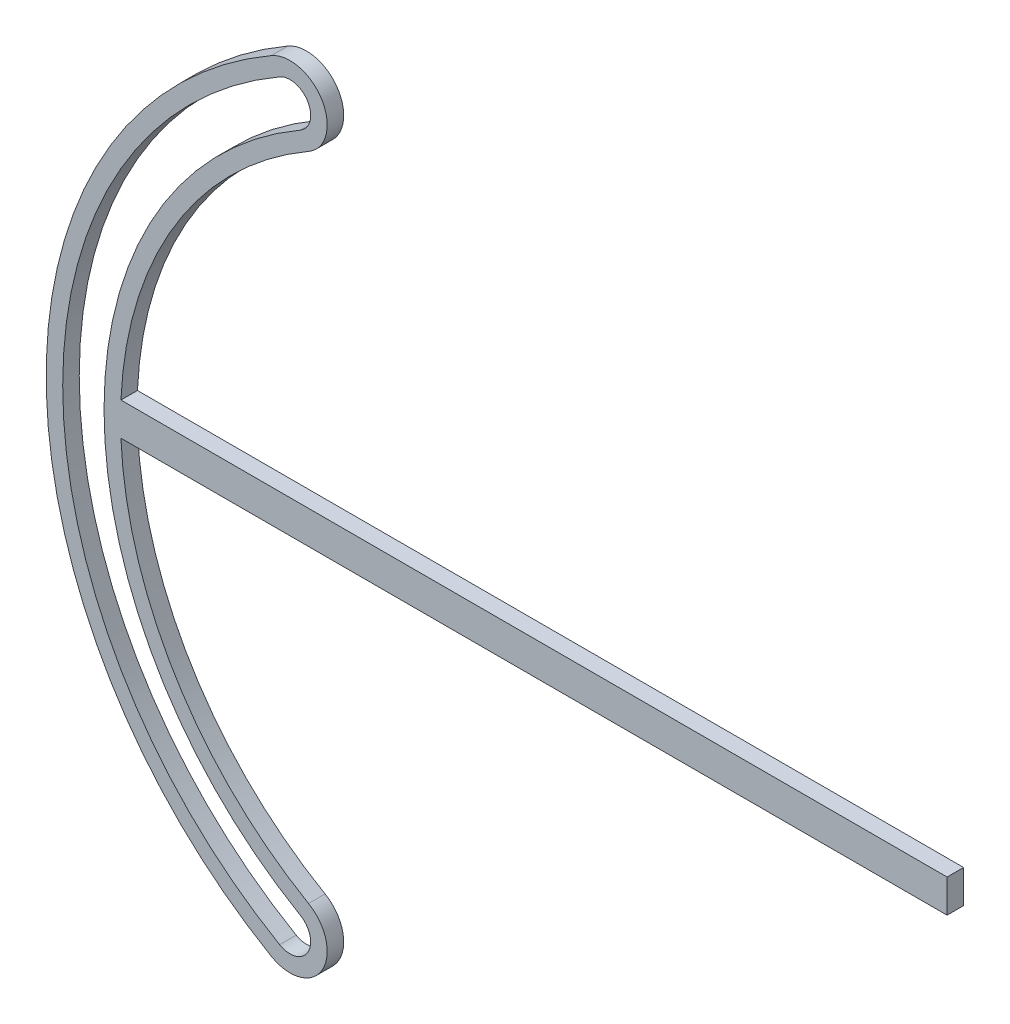
ISO-10303-21;
HEADER;
FILE_DESCRIPTION(('STEP AP214'),'2;1');
FILE_NAME('part.step','',(''),(''),'','','');
FILE_SCHEMA(('AUTOMOTIVE_DESIGN { 1 0 10303 214 1 1 1 1 }'));
ENDSEC;
DATA;
#1=APPLICATION_CONTEXT('core data for automotive mechanical design processes');
#2=APPLICATION_PROTOCOL_DEFINITION('international standard','automotive_design',2000,#1);
#3=PRODUCT_CONTEXT('',#1,'mechanical');
#4=PRODUCT('Part','Part','',(#3));
#5=PRODUCT_RELATED_PRODUCT_CATEGORY('part','',(#4));
#6=PRODUCT_DEFINITION_FORMATION('','',#4);
#7=PRODUCT_DEFINITION_CONTEXT('part definition',#1,'design');
#8=PRODUCT_DEFINITION('design','',#6,#7);
#9=PRODUCT_DEFINITION_SHAPE('','',#8);
#10=(LENGTH_UNIT() NAMED_UNIT(*) SI_UNIT(.MILLI.,.METRE.));
#11=(NAMED_UNIT(*) PLANE_ANGLE_UNIT() SI_UNIT($,.RADIAN.));
#12=(NAMED_UNIT(*) SI_UNIT($,.STERADIAN.) SOLID_ANGLE_UNIT());
#13=UNCERTAINTY_MEASURE_WITH_UNIT(LENGTH_MEASURE(1.E-05),#10,'distance_accuracy_value','');
#14=(GEOMETRIC_REPRESENTATION_CONTEXT(3) GLOBAL_UNCERTAINTY_ASSIGNED_CONTEXT((#13)) GLOBAL_UNIT_ASSIGNED_CONTEXT((#10,
#11,#12)) REPRESENTATION_CONTEXT('',''));
#15=CARTESIAN_POINT('',(0.,0.,0.));
#16=DIRECTION('',(0.,0.,1.));
#17=DIRECTION('',(1.,0.,0.));
#18=AXIS2_PLACEMENT_3D('',#15,#16,#17);
#19=CARTESIAN_POINT('',(0.,0.,4.));
#20=DIRECTION('',(0.,0.,-1.));
#21=DIRECTION('',(-1.,0.,0.));
#22=AXIS2_PLACEMENT_3D('',#19,#20,#21);
#23=CYLINDRICAL_SURFACE('',#22,91.);
#24=CARTESIAN_POINT('',(0.,0.,0.));
#25=DIRECTION('',(0.,0.,1.));
#26=DIRECTION('',(1.,0.,0.));
#27=AXIS2_PLACEMENT_3D('',#24,#25,#26);
#28=CIRCLE('',#27,91.);
#29=CARTESIAN_POINT('',(-45.4999999999998,78.808311744384,0.));
#30=VERTEX_POINT('',#29);
#31=CARTESIAN_POINT('',(-90.9120454065357,4.,0.));
#32=VERTEX_POINT('',#31);
#33=EDGE_CURVE('E169',#30,#32,#28,.T.);
#34=ORIENTED_EDGE('',*,*,#33,.F.);
#35=DIRECTION('',(0.,0.,-1.));
#36=VECTOR('',#35,1.);
#37=CARTESIAN_POINT('',(-45.4999999999998,78.808311744384,4.));
#38=LINE('',#37,#36);
#39=CARTESIAN_POINT('',(-45.4999999999998,78.808311744384,4.));
#40=VERTEX_POINT('',#39);
#41=EDGE_CURVE('E11',#40,#30,#38,.T.);
#42=ORIENTED_EDGE('',*,*,#41,.F.);
#43=CARTESIAN_POINT('',(0.,0.,4.));
#44=DIRECTION('',(0.,0.,1.));
#45=DIRECTION('',(1.,0.,0.));
#46=AXIS2_PLACEMENT_3D('',#43,#44,#45);
#47=CIRCLE('',#46,91.);
#48=CARTESIAN_POINT('',(-90.9120454065357,4.,4.));
#49=VERTEX_POINT('',#48);
#50=EDGE_CURVE('E270',#40,#49,#47,.T.);
#51=ORIENTED_EDGE('',*,*,#50,.T.);
#52=DIRECTION('',(0.,0.,-1.));
#53=VECTOR('',#52,1.);
#54=CARTESIAN_POINT('',(-90.9120454065357,4.,4.));
#55=LINE('',#54,#53);
#56=EDGE_CURVE('E52',#49,#32,#55,.T.);
#57=ORIENTED_EDGE('',*,*,#56,.T.);
#58=EDGE_LOOP('',(#34,#42,#51,#57));
#59=FACE_BOUND('',#58,.T.);
#60=ADVANCED_FACE('F33',(#59),#23,.F.);
#61=CARTESIAN_POINT('',(-49.9999999999998,86.602540378444,4.));
#62=DIRECTION('',(0.,0.,-1.));
#63=DIRECTION('',(-1.,0.,0.));
#64=AXIS2_PLACEMENT_3D('',#61,#62,#63);
#65=CYLINDRICAL_SURFACE('',#64,9.);
#66=CARTESIAN_POINT('',(-49.9999999999998,86.602540378444,0.));
#67=DIRECTION('',(0.,0.,1.));
#68=DIRECTION('',(1.,0.,0.));
#69=AXIS2_PLACEMENT_3D('',#66,#67,#68);
#70=CIRCLE('',#69,9.);
#71=CARTESIAN_POINT('',(-54.4999999999998,94.396769012504,0.));
#72=VERTEX_POINT('',#71);
#73=EDGE_CURVE('E171',#30,#72,#70,.T.);
#74=ORIENTED_EDGE('',*,*,#73,.T.);
#75=DIRECTION('',(0.,0.,-1.));
#76=VECTOR('',#75,1.);
#77=CARTESIAN_POINT('',(-54.4999999999998,94.396769012504,4.));
#78=LINE('',#77,#76);
#79=CARTESIAN_POINT('',(-54.4999999999998,94.396769012504,4.));
#80=VERTEX_POINT('',#79);
#81=EDGE_CURVE('E43',#80,#72,#78,.T.);
#82=ORIENTED_EDGE('',*,*,#81,.F.);
#83=CARTESIAN_POINT('',(-49.9999999999998,86.602540378444,4.));
#84=DIRECTION('',(0.,0.,1.));
#85=DIRECTION('',(1.,0.,0.));
#86=AXIS2_PLACEMENT_3D('',#83,#84,#85);
#87=CIRCLE('',#86,9.);
#88=EDGE_CURVE('E272',#40,#80,#87,.T.);
#89=ORIENTED_EDGE('',*,*,#88,.F.);
#90=ORIENTED_EDGE('',*,*,#41,.T.);
#91=EDGE_LOOP('',(#74,#82,#89,#90));
#92=FACE_BOUND('',#91,.T.);
#93=ADVANCED_FACE('F232',(#92),#65,.T.);
#94=CARTESIAN_POINT('',(0.,0.,4.));
#95=DIRECTION('',(0.,0.,-1.));
#96=DIRECTION('',(-1.,0.,0.));
#97=AXIS2_PLACEMENT_3D('',#94,#95,#96);
#98=CYLINDRICAL_SURFACE('',#97,109.);
#99=CARTESIAN_POINT('',(0.,0.,0.));
#100=DIRECTION('',(0.,0.,1.));
#101=DIRECTION('',(1.,0.,0.));
#102=AXIS2_PLACEMENT_3D('',#99,#100,#101);
#103=CIRCLE('',#102,109.);
#104=CARTESIAN_POINT('',(-54.4999999999998,-94.396769012504,0.));
#105=VERTEX_POINT('',#104);
#106=EDGE_CURVE('E174',#72,#105,#103,.T.);
#107=ORIENTED_EDGE('',*,*,#106,.T.);
#108=DIRECTION('',(0.,0.,-1.));
#109=VECTOR('',#108,1.);
#110=CARTESIAN_POINT('',(-54.4999999999998,-94.396769012504,4.));
#111=LINE('',#110,#109);
#112=CARTESIAN_POINT('',(-54.4999999999998,-94.396769012504,4.));
#113=VERTEX_POINT('',#112);
#114=EDGE_CURVE('E195',#113,#105,#111,.T.);
#115=ORIENTED_EDGE('',*,*,#114,.F.);
#116=CARTESIAN_POINT('',(0.,0.,4.));
#117=DIRECTION('',(0.,0.,1.));
#118=DIRECTION('',(1.,0.,0.));
#119=AXIS2_PLACEMENT_3D('',#116,#117,#118);
#120=CIRCLE('',#119,109.);
#121=EDGE_CURVE('E275',#80,#113,#120,.T.);
#122=ORIENTED_EDGE('',*,*,#121,.F.);
#123=ORIENTED_EDGE('',*,*,#81,.T.);
#124=EDGE_LOOP('',(#107,#115,#122,#123));
#125=FACE_BOUND('',#124,.T.);
#126=ADVANCED_FACE('F237',(#125),#98,.T.);
#127=CARTESIAN_POINT('',(-49.9999999999998,-86.602540378444,4.));
#128=DIRECTION('',(0.,0.,-1.));
#129=DIRECTION('',(-1.,0.,0.));
#130=AXIS2_PLACEMENT_3D('',#127,#128,#129);
#131=CYLINDRICAL_SURFACE('',#130,9.00000000000001);
#132=CARTESIAN_POINT('',(-49.9999999999998,-86.602540378444,0.));
#133=DIRECTION('',(0.,0.,1.));
#134=DIRECTION('',(1.,0.,0.));
#135=AXIS2_PLACEMENT_3D('',#132,#133,#134);
#136=CIRCLE('',#135,9.00000000000001);
#137=CARTESIAN_POINT('',(-45.4999999999998,-78.808311744384,0.));
#138=VERTEX_POINT('',#137);
#139=EDGE_CURVE('E177',#105,#138,#136,.T.);
#140=ORIENTED_EDGE('',*,*,#139,.T.);
#141=DIRECTION('',(0.,0.,-1.));
#142=VECTOR('',#141,1.);
#143=CARTESIAN_POINT('',(-45.4999999999998,-78.808311744384,4.));
#144=LINE('',#143,#142);
#145=CARTESIAN_POINT('',(-45.4999999999998,-78.808311744384,4.));
#146=VERTEX_POINT('',#145);
#147=EDGE_CURVE('E193',#146,#138,#144,.T.);
#148=ORIENTED_EDGE('',*,*,#147,.F.);
#149=CARTESIAN_POINT('',(-49.9999999999998,-86.602540378444,4.));
#150=DIRECTION('',(0.,0.,1.));
#151=DIRECTION('',(1.,0.,0.));
#152=AXIS2_PLACEMENT_3D('',#149,#150,#151);
#153=CIRCLE('',#152,9.00000000000001);
#154=EDGE_CURVE('E278',#113,#146,#153,.T.);
#155=ORIENTED_EDGE('',*,*,#154,.F.);
#156=ORIENTED_EDGE('',*,*,#114,.T.);
#157=EDGE_LOOP('',(#140,#148,#155,#156));
#158=FACE_BOUND('',#157,.T.);
#159=ADVANCED_FACE('F243',(#158),#131,.T.);
#160=CARTESIAN_POINT('',(0.,0.,4.));
#161=DIRECTION('',(0.,0.,-1.));
#162=DIRECTION('',(-1.,0.,0.));
#163=AXIS2_PLACEMENT_3D('',#160,#161,#162);
#164=CYLINDRICAL_SURFACE('',#163,91.);
#165=CARTESIAN_POINT('',(0.,0.,0.));
#166=DIRECTION('',(0.,0.,1.));
#167=DIRECTION('',(1.,0.,0.));
#168=AXIS2_PLACEMENT_3D('',#165,#166,#167);
#169=CIRCLE('',#168,91.);
#170=CARTESIAN_POINT('',(-90.9120454065357,-4.,0.));
#171=VERTEX_POINT('',#170);
#172=EDGE_CURVE('E180',#171,#138,#169,.T.);
#173=ORIENTED_EDGE('',*,*,#172,.F.);
#174=DIRECTION('',(0.,0.,-1.));
#175=VECTOR('',#174,1.);
#176=CARTESIAN_POINT('',(-90.9120454065357,-4.,4.));
#177=LINE('',#176,#175);
#178=CARTESIAN_POINT('',(-90.9120454065357,-4.,4.));
#179=VERTEX_POINT('',#178);
#180=EDGE_CURVE('E138',#179,#171,#177,.T.);
#181=ORIENTED_EDGE('',*,*,#180,.F.);
#182=CARTESIAN_POINT('',(0.,0.,4.));
#183=DIRECTION('',(0.,0.,1.));
#184=DIRECTION('',(1.,0.,0.));
#185=AXIS2_PLACEMENT_3D('',#182,#183,#184);
#186=CIRCLE('',#185,91.);
#187=EDGE_CURVE('E148',#179,#146,#186,.T.);
#188=ORIENTED_EDGE('',*,*,#187,.T.);
#189=ORIENTED_EDGE('',*,*,#147,.T.);
#190=EDGE_LOOP('',(#173,#181,#188,#189));
#191=FACE_BOUND('',#190,.T.);
#192=ADVANCED_FACE('F247',(#191),#164,.F.);
#193=CARTESIAN_POINT('',(-34.5628567237679,-4.,4.));
#194=DIRECTION('',(0.,-1.,0.));
#195=DIRECTION('',(0.,0.,-1.));
#196=AXIS2_PLACEMENT_3D('',#193,#194,#195);
#197=PLANE('',#196);
#198=DIRECTION('',(-1.,0.,0.));
#199=VECTOR('',#198,1.);
#200=CARTESIAN_POINT('',(-34.5628567237679,-4.,0.));
#201=LINE('',#200,#199);
#202=CARTESIAN_POINT('',(109.,-4.,0.));
#203=VERTEX_POINT('',#202);
#204=EDGE_CURVE('E134',#203,#171,#201,.T.);
#205=ORIENTED_EDGE('',*,*,#204,.F.);
#206=DIRECTION('',(0.,0.,-1.));
#207=VECTOR('',#206,1.);
#208=CARTESIAN_POINT('',(109.,-4.,4.));
#209=LINE('',#208,#207);
#210=CARTESIAN_POINT('',(109.,-4.,4.));
#211=VERTEX_POINT('',#210);
#212=EDGE_CURVE('E129',#211,#203,#209,.T.);
#213=ORIENTED_EDGE('',*,*,#212,.F.);
#214=DIRECTION('',(-1.,0.,0.));
#215=VECTOR('',#214,1.);
#216=CARTESIAN_POINT('',(-34.5628567237679,-4.,4.));
#217=LINE('',#216,#215);
#218=EDGE_CURVE('E132',#211,#179,#217,.T.);
#219=ORIENTED_EDGE('',*,*,#218,.T.);
#220=ORIENTED_EDGE('',*,*,#180,.T.);
#221=EDGE_LOOP('',(#205,#213,#219,#220));
#222=FACE_BOUND('',#221,.T.);
#223=ADVANCED_FACE('F131',(#222),#197,.T.);
#224=CARTESIAN_POINT('',(109.,-231.149990770893,4.));
#225=DIRECTION('',(1.,0.,0.));
#226=DIRECTION('',(0.,0.,-1.));
#227=AXIS2_PLACEMENT_3D('',#224,#225,#226);
#228=PLANE('',#227);
#229=DIRECTION('',(0.,-1.,0.));
#230=VECTOR('',#229,1.);
#231=CARTESIAN_POINT('',(109.,-231.149990770893,0.));
#232=LINE('',#231,#230);
#233=CARTESIAN_POINT('',(109.,4.,0.));
#234=VERTEX_POINT('',#233);
#235=EDGE_CURVE('E184',#234,#203,#232,.T.);
#236=ORIENTED_EDGE('',*,*,#235,.F.);
#237=DIRECTION('',(0.,0.,-1.));
#238=VECTOR('',#237,1.);
#239=CARTESIAN_POINT('',(109.,4.,4.));
#240=LINE('',#239,#238);
#241=CARTESIAN_POINT('',(109.,4.,4.));
#242=VERTEX_POINT('',#241);
#243=EDGE_CURVE('E89',#242,#234,#240,.T.);
#244=ORIENTED_EDGE('',*,*,#243,.F.);
#245=DIRECTION('',(0.,-1.,0.));
#246=VECTOR('',#245,1.);
#247=CARTESIAN_POINT('',(109.,-231.149990770893,4.));
#248=LINE('',#247,#246);
#249=EDGE_CURVE('E146',#242,#211,#248,.T.);
#250=ORIENTED_EDGE('',*,*,#249,.T.);
#251=ORIENTED_EDGE('',*,*,#212,.T.);
#252=EDGE_LOOP('',(#236,#244,#250,#251));
#253=FACE_BOUND('',#252,.T.);
#254=ADVANCED_FACE('F150',(#253),#228,.T.);
#255=CARTESIAN_POINT('',(-49.9999999999998,86.602540378444,4.));
#256=DIRECTION('',(0.,0.,-1.));
#257=DIRECTION('',(-1.,0.,0.));
#258=AXIS2_PLACEMENT_3D('',#255,#256,#257);
#259=CYLINDRICAL_SURFACE('',#258,5.);
#260=CARTESIAN_POINT('',(-49.9999999999998,86.602540378444,0.));
#261=DIRECTION('',(0.,0.,1.));
#262=DIRECTION('',(1.,0.,0.));
#263=AXIS2_PLACEMENT_3D('',#260,#261,#262);
#264=CIRCLE('',#263,5.);
#265=CARTESIAN_POINT('',(-47.4999999999998,82.2724133595218,0.));
#266=VERTEX_POINT('',#265);
#267=CARTESIAN_POINT('',(-52.4999999999998,90.9326673973662,0.));
#268=VERTEX_POINT('',#267);
#269=EDGE_CURVE('E157',#266,#268,#264,.T.);
#270=ORIENTED_EDGE('',*,*,#269,.F.);
#271=DIRECTION('',(0.,0.,-1.));
#272=VECTOR('',#271,1.);
#273=CARTESIAN_POINT('',(-47.4999999999998,82.2724133595218,4.));
#274=LINE('',#273,#272);
#275=CARTESIAN_POINT('',(-47.4999999999998,82.2724133595218,4.));
#276=VERTEX_POINT('',#275);
#277=EDGE_CURVE('E37',#276,#266,#274,.T.);
#278=ORIENTED_EDGE('',*,*,#277,.F.);
#279=CARTESIAN_POINT('',(-49.9999999999998,86.602540378444,4.));
#280=DIRECTION('',(0.,0.,1.));
#281=DIRECTION('',(1.,0.,0.));
#282=AXIS2_PLACEMENT_3D('',#279,#280,#281);
#283=CIRCLE('',#282,5.);
#284=CARTESIAN_POINT('',(-52.4999999999998,90.9326673973662,4.));
#285=VERTEX_POINT('',#284);
#286=EDGE_CURVE('E189',#276,#285,#283,.T.);
#287=ORIENTED_EDGE('',*,*,#286,.T.);
#288=DIRECTION('',(0.,0.,-1.));
#289=VECTOR('',#288,1.);
#290=CARTESIAN_POINT('',(-52.4999999999998,90.9326673973662,4.));
#291=LINE('',#290,#289);
#292=EDGE_CURVE('E153',#285,#268,#291,.T.);
#293=ORIENTED_EDGE('',*,*,#292,.T.);
#294=EDGE_LOOP('',(#270,#278,#287,#293));
#295=FACE_BOUND('',#294,.T.);
#296=ADVANCED_FACE('F35',(#295),#259,.F.);
#297=CARTESIAN_POINT('',(0.,0.,4.));
#298=DIRECTION('',(0.,0.,-1.));
#299=DIRECTION('',(-1.,0.,0.));
#300=AXIS2_PLACEMENT_3D('',#297,#298,#299);
#301=CYLINDRICAL_SURFACE('',#300,95.);
#302=CARTESIAN_POINT('',(0.,0.,0.));
#303=DIRECTION('',(0.,0.,1.));
#304=DIRECTION('',(1.,0.,0.));
#305=AXIS2_PLACEMENT_3D('',#302,#303,#304);
#306=CIRCLE('',#305,95.);
#307=CARTESIAN_POINT('',(-47.4999999999998,-82.2724133595218,0.));
#308=VERTEX_POINT('',#307);
#309=EDGE_CURVE('E160',#266,#308,#306,.T.);
#310=ORIENTED_EDGE('',*,*,#309,.T.);
#311=DIRECTION('',(0.,0.,-1.));
#312=VECTOR('',#311,1.);
#313=CARTESIAN_POINT('',(-47.4999999999998,-82.2724133595218,4.));
#314=LINE('',#313,#312);
#315=CARTESIAN_POINT('',(-47.4999999999998,-82.2724133595218,4.));
#316=VERTEX_POINT('',#315);
#317=EDGE_CURVE('E202',#316,#308,#314,.T.);
#318=ORIENTED_EDGE('',*,*,#317,.F.);
#319=CARTESIAN_POINT('',(0.,0.,4.));
#320=DIRECTION('',(0.,0.,1.));
#321=DIRECTION('',(1.,0.,0.));
#322=AXIS2_PLACEMENT_3D('',#319,#320,#321);
#323=CIRCLE('',#322,95.);
#324=EDGE_CURVE('E210',#276,#316,#323,.T.);
#325=ORIENTED_EDGE('',*,*,#324,.F.);
#326=ORIENTED_EDGE('',*,*,#277,.T.);
#327=EDGE_LOOP('',(#310,#318,#325,#326));
#328=FACE_BOUND('',#327,.T.);
#329=ADVANCED_FACE('F209',(#328),#301,.T.);
#330=CARTESIAN_POINT('',(-49.9999999999998,-86.602540378444,4.));
#331=DIRECTION('',(0.,0.,-1.));
#332=DIRECTION('',(-1.,0.,0.));
#333=AXIS2_PLACEMENT_3D('',#330,#331,#332);
#334=CYLINDRICAL_SURFACE('',#333,5.00000000000001);
#335=CARTESIAN_POINT('',(-49.9999999999998,-86.602540378444,0.));
#336=DIRECTION('',(0.,0.,1.));
#337=DIRECTION('',(1.,0.,0.));
#338=AXIS2_PLACEMENT_3D('',#335,#336,#337);
#339=CIRCLE('',#338,5.00000000000001);
#340=CARTESIAN_POINT('',(-52.4999999999998,-90.9326673973662,0.));
#341=VERTEX_POINT('',#340);
#342=EDGE_CURVE('E163',#341,#308,#339,.T.);
#343=ORIENTED_EDGE('',*,*,#342,.F.);
#344=DIRECTION('',(0.,0.,-1.));
#345=VECTOR('',#344,1.);
#346=CARTESIAN_POINT('',(-52.4999999999998,-90.9326673973662,4.));
#347=LINE('',#346,#345);
#348=CARTESIAN_POINT('',(-52.4999999999998,-90.9326673973662,4.));
#349=VERTEX_POINT('',#348);
#350=EDGE_CURVE('E201',#349,#341,#347,.T.);
#351=ORIENTED_EDGE('',*,*,#350,.F.);
#352=CARTESIAN_POINT('',(-49.9999999999998,-86.602540378444,4.));
#353=DIRECTION('',(0.,0.,1.));
#354=DIRECTION('',(1.,0.,0.));
#355=AXIS2_PLACEMENT_3D('',#352,#353,#354);
#356=CIRCLE('',#355,5.00000000000001);
#357=EDGE_CURVE('E265',#349,#316,#356,.T.);
#358=ORIENTED_EDGE('',*,*,#357,.T.);
#359=ORIENTED_EDGE('',*,*,#317,.T.);
#360=EDGE_LOOP('',(#343,#351,#358,#359));
#361=FACE_BOUND('',#360,.T.);
#362=ADVANCED_FACE('F222',(#361),#334,.F.);
#363=CARTESIAN_POINT('',(0.,0.,4.));
#364=DIRECTION('',(0.,0.,-1.));
#365=DIRECTION('',(-1.,0.,0.));
#366=AXIS2_PLACEMENT_3D('',#363,#364,#365);
#367=CYLINDRICAL_SURFACE('',#366,105.);
#368=CARTESIAN_POINT('',(0.,0.,0.));
#369=DIRECTION('',(0.,0.,1.));
#370=DIRECTION('',(1.,0.,0.));
#371=AXIS2_PLACEMENT_3D('',#368,#369,#370);
#372=CIRCLE('',#371,105.);
#373=EDGE_CURVE('E166',#268,#341,#372,.T.);
#374=ORIENTED_EDGE('',*,*,#373,.F.);
#375=ORIENTED_EDGE('',*,*,#292,.F.);
#376=CARTESIAN_POINT('',(0.,0.,4.));
#377=DIRECTION('',(0.,0.,1.));
#378=DIRECTION('',(1.,0.,0.));
#379=AXIS2_PLACEMENT_3D('',#376,#377,#378);
#380=CIRCLE('',#379,105.);
#381=EDGE_CURVE('E220',#285,#349,#380,.T.);
#382=ORIENTED_EDGE('',*,*,#381,.T.);
#383=ORIENTED_EDGE('',*,*,#350,.T.);
#384=EDGE_LOOP('',(#374,#375,#382,#383));
#385=FACE_BOUND('',#384,.T.);
#386=ADVANCED_FACE('F219',(#385),#367,.F.);
#387=CARTESIAN_POINT('',(-34.5628567237679,4.,4.));
#388=DIRECTION('',(0.,1.,0.));
#389=DIRECTION('',(0.,0.,1.));
#390=AXIS2_PLACEMENT_3D('',#387,#388,#389);
#391=PLANE('',#390);
#392=DIRECTION('',(1.,0.,0.));
#393=VECTOR('',#392,1.);
#394=CARTESIAN_POINT('',(-34.5628567237679,4.,0.));
#395=LINE('',#394,#393);
#396=EDGE_CURVE('E186',#32,#234,#395,.T.);
#397=ORIENTED_EDGE('',*,*,#396,.F.);
#398=ORIENTED_EDGE('',*,*,#56,.F.);
#399=DIRECTION('',(1.,0.,0.));
#400=VECTOR('',#399,1.);
#401=CARTESIAN_POINT('',(-34.5628567237679,4.,4.));
#402=LINE('',#401,#400);
#403=EDGE_CURVE('E151',#49,#242,#402,.T.);
#404=ORIENTED_EDGE('',*,*,#403,.T.);
#405=ORIENTED_EDGE('',*,*,#243,.T.);
#406=EDGE_LOOP('',(#397,#398,#404,#405));
#407=FACE_BOUND('',#406,.T.);
#408=ADVANCED_FACE('F229',(#407),#391,.T.);
#409=CARTESIAN_POINT('',(-34.5628567237679,-231.149990770893,4.));
#410=DIRECTION('',(0.,0.,1.));
#411=DIRECTION('',(1.,0.,0.));
#412=AXIS2_PLACEMENT_3D('',#409,#410,#411);
#413=PLANE('',#412);
#414=ORIENTED_EDGE('',*,*,#286,.F.);
#415=ORIENTED_EDGE('',*,*,#324,.T.);
#416=ORIENTED_EDGE('',*,*,#357,.F.);
#417=ORIENTED_EDGE('',*,*,#381,.F.);
#418=EDGE_LOOP('',(#414,#415,#416,#417));
#419=FACE_BOUND('',#418,.T.);
#420=ORIENTED_EDGE('',*,*,#50,.F.);
#421=ORIENTED_EDGE('',*,*,#88,.T.);
#422=ORIENTED_EDGE('',*,*,#121,.T.);
#423=ORIENTED_EDGE('',*,*,#154,.T.);
#424=ORIENTED_EDGE('',*,*,#187,.F.);
#425=ORIENTED_EDGE('',*,*,#218,.F.);
#426=ORIENTED_EDGE('',*,*,#249,.F.);
#427=ORIENTED_EDGE('',*,*,#403,.F.);
#428=EDGE_LOOP('',(#420,#421,#422,#423,#424,#425,#426,#427));
#429=FACE_BOUND('',#428,.T.);
#430=ADVANCED_FACE('F144',(#419,#429),#413,.T.);
#431=CARTESIAN_POINT('',(-34.5628567237679,-231.149990770893,0.));
#432=DIRECTION('',(0.,0.,1.));
#433=DIRECTION('',(1.,0.,0.));
#434=AXIS2_PLACEMENT_3D('',#431,#432,#433);
#435=PLANE('',#434);
#436=ORIENTED_EDGE('',*,*,#269,.T.);
#437=ORIENTED_EDGE('',*,*,#373,.T.);
#438=ORIENTED_EDGE('',*,*,#342,.T.);
#439=ORIENTED_EDGE('',*,*,#309,.F.);
#440=EDGE_LOOP('',(#436,#437,#438,#439));
#441=FACE_BOUND('',#440,.T.);
#442=ORIENTED_EDGE('',*,*,#33,.T.);
#443=ORIENTED_EDGE('',*,*,#396,.T.);
#444=ORIENTED_EDGE('',*,*,#235,.T.);
#445=ORIENTED_EDGE('',*,*,#204,.T.);
#446=ORIENTED_EDGE('',*,*,#172,.T.);
#447=ORIENTED_EDGE('',*,*,#139,.F.);
#448=ORIENTED_EDGE('',*,*,#106,.F.);
#449=ORIENTED_EDGE('',*,*,#73,.F.);
#450=EDGE_LOOP('',(#442,#443,#444,#445,#446,#447,#448,#449));
#451=FACE_BOUND('',#450,.T.);
#452=ADVANCED_FACE('F213',(#441,#451),#435,.F.);
#453=CLOSED_SHELL('',(#60,#93,#126,#159,#192,#223,#254,#296,#329,#362,#386,#408,#430,#452));
#454=MANIFOLD_SOLID_BREP('B2',#453);
#455=ADVANCED_BREP_SHAPE_REPRESENTATION('',(#18,#454),#14);
#456=SHAPE_DEFINITION_REPRESENTATION(#9,#455);
ENDSEC;
END-ISO-10303-21;
